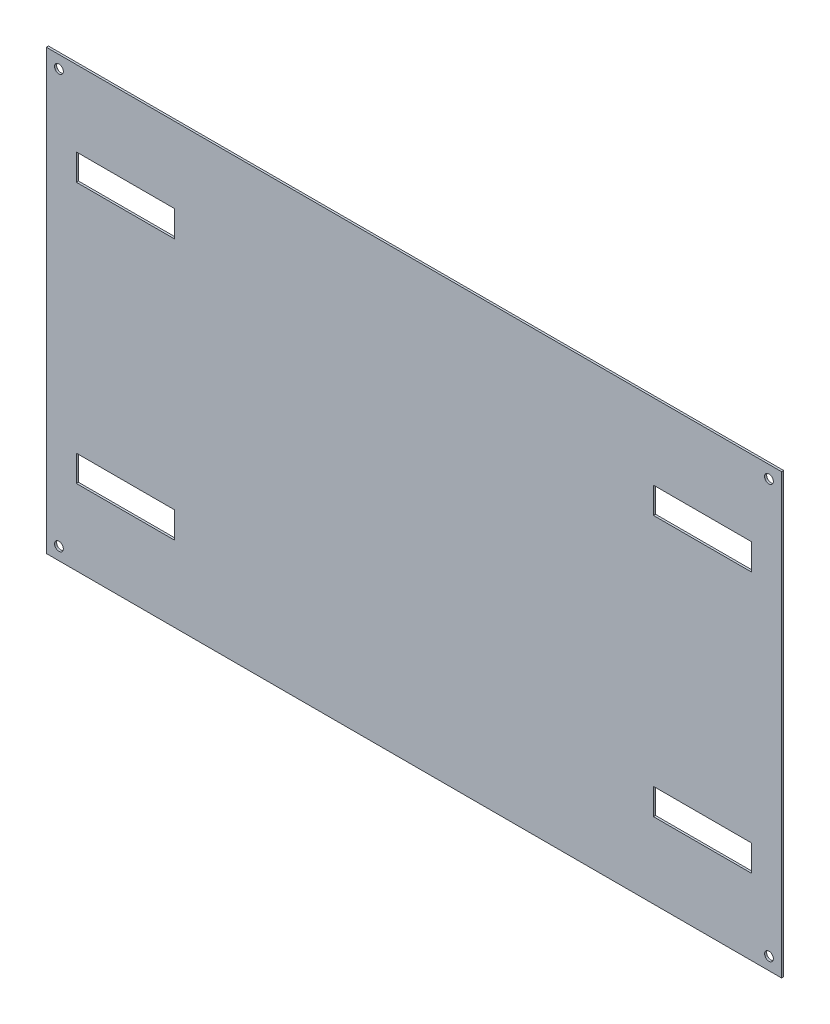
ISO-10303-21;
HEADER;
FILE_DESCRIPTION(('STEP AP214'),'2;1');
FILE_NAME('part.step','',(''),(''),'','','');
FILE_SCHEMA(('AUTOMOTIVE_DESIGN { 1 0 10303 214 1 1 1 1 }'));
ENDSEC;
DATA;
#1=APPLICATION_CONTEXT('core data for automotive mechanical design processes');
#2=APPLICATION_PROTOCOL_DEFINITION('international standard','automotive_design',2000,#1);
#3=PRODUCT_CONTEXT('',#1,'mechanical');
#4=PRODUCT('Part','Part','',(#3));
#5=PRODUCT_RELATED_PRODUCT_CATEGORY('part','',(#4));
#6=PRODUCT_DEFINITION_FORMATION('','',#4);
#7=PRODUCT_DEFINITION_CONTEXT('part definition',#1,'design');
#8=PRODUCT_DEFINITION('design','',#6,#7);
#9=PRODUCT_DEFINITION_SHAPE('','',#8);
#10=(LENGTH_UNIT() NAMED_UNIT(*) SI_UNIT(.MILLI.,.METRE.));
#11=(NAMED_UNIT(*) PLANE_ANGLE_UNIT() SI_UNIT($,.RADIAN.));
#12=(NAMED_UNIT(*) SI_UNIT($,.STERADIAN.) SOLID_ANGLE_UNIT());
#13=UNCERTAINTY_MEASURE_WITH_UNIT(LENGTH_MEASURE(1.E-05),#10,'distance_accuracy_value','');
#14=(GEOMETRIC_REPRESENTATION_CONTEXT(3) GLOBAL_UNCERTAINTY_ASSIGNED_CONTEXT((#13)) GLOBAL_UNIT_ASSIGNED_CONTEXT((#10,
#11,#12)) REPRESENTATION_CONTEXT('',''));
#15=CARTESIAN_POINT('',(0.,0.,0.));
#16=DIRECTION('',(0.,0.,1.));
#17=DIRECTION('',(1.,0.,0.));
#18=AXIS2_PLACEMENT_3D('',#15,#16,#17);
#19=CARTESIAN_POINT('',(0.,0.,2.4));
#20=DIRECTION('',(0.,0.,-1.));
#21=DIRECTION('',(-1.,0.,0.));
#22=AXIS2_PLACEMENT_3D('',#19,#20,#21);
#23=PLANE('',#22);
#24=DIRECTION('',(0.,1.,0.));
#25=VECTOR('',#24,1.);
#26=CARTESIAN_POINT('',(693.68,86.4699999999982,2.4));
#27=LINE('',#26,#25);
#28=CARTESIAN_POINT('',(693.68,86.4699999999982,2.4));
#29=VERTEX_POINT('',#28);
#30=CARTESIAN_POINT('',(693.68,116.469999999998,2.4));
#31=VERTEX_POINT('',#30);
#32=EDGE_CURVE('E212',#29,#31,#27,.T.);
#33=ORIENTED_EDGE('',*,*,#32,.T.);
#34=DIRECTION('',(1.,0.,0.));
#35=VECTOR('',#34,1.);
#36=CARTESIAN_POINT('',(805.68,116.469999999998,2.4));
#37=LINE('',#36,#35);
#38=CARTESIAN_POINT('',(805.68,116.469999999998,2.4));
#39=VERTEX_POINT('',#38);
#40=EDGE_CURVE('E227',#31,#39,#37,.T.);
#41=ORIENTED_EDGE('',*,*,#40,.T.);
#42=DIRECTION('',(0.,-1.,0.));
#43=VECTOR('',#42,1.);
#44=CARTESIAN_POINT('',(805.68,116.469999999998,2.4));
#45=LINE('',#44,#43);
#46=CARTESIAN_POINT('',(805.68,86.4699999999982,2.4));
#47=VERTEX_POINT('',#46);
#48=EDGE_CURVE('E224',#39,#47,#45,.T.);
#49=ORIENTED_EDGE('',*,*,#48,.T.);
#50=DIRECTION('',(-1.,0.,0.));
#51=VECTOR('',#50,1.);
#52=CARTESIAN_POINT('',(693.68,86.4699999999982,2.4));
#53=LINE('',#52,#51);
#54=EDGE_CURVE('E221',#47,#29,#53,.T.);
#55=ORIENTED_EDGE('',*,*,#54,.T.);
#56=EDGE_LOOP('',(#33,#41,#49,#55));
#57=FACE_BOUND('',#56,.T.);
#58=DIRECTION('',(-1.,0.,0.));
#59=VECTOR('',#58,1.);
#60=CARTESIAN_POINT('',(34.32,116.469999999998,2.4));
#61=LINE('',#60,#59);
#62=CARTESIAN_POINT('',(146.32,116.469999999998,2.4));
#63=VERTEX_POINT('',#62);
#64=CARTESIAN_POINT('',(34.32,116.469999999998,2.4));
#65=VERTEX_POINT('',#64);
#66=EDGE_CURVE('E241',#63,#65,#61,.T.);
#67=ORIENTED_EDGE('',*,*,#66,.F.);
#68=DIRECTION('',(0.,1.,0.));
#69=VECTOR('',#68,1.);
#70=CARTESIAN_POINT('',(146.32,86.4699999999984,2.4));
#71=LINE('',#70,#69);
#72=CARTESIAN_POINT('',(146.32,86.4699999999984,2.4));
#73=VERTEX_POINT('',#72);
#74=EDGE_CURVE('E233',#73,#63,#71,.T.);
#75=ORIENTED_EDGE('',*,*,#74,.F.);
#76=DIRECTION('',(1.,0.,0.));
#77=VECTOR('',#76,1.);
#78=CARTESIAN_POINT('',(146.32,86.4699999999984,2.4));
#79=LINE('',#78,#77);
#80=CARTESIAN_POINT('',(34.32,86.4699999999984,2.4));
#81=VERTEX_POINT('',#80);
#82=EDGE_CURVE('E247',#81,#73,#79,.T.);
#83=ORIENTED_EDGE('',*,*,#82,.F.);
#84=DIRECTION('',(0.,-1.,0.));
#85=VECTOR('',#84,1.);
#86=CARTESIAN_POINT('',(34.32,116.469999999998,2.4));
#87=LINE('',#86,#85);
#88=EDGE_CURVE('E244',#65,#81,#87,.T.);
#89=ORIENTED_EDGE('',*,*,#88,.F.);
#90=EDGE_LOOP('',(#67,#75,#83,#89));
#91=FACE_BOUND('',#90,.T.);
#92=DIRECTION('',(0.,1.,0.));
#93=VECTOR('',#92,1.);
#94=CARTESIAN_POINT('',(840.,0.,2.4));
#95=LINE('',#94,#93);
#96=CARTESIAN_POINT('',(840.,0.,2.4));
#97=VERTEX_POINT('',#96);
#98=CARTESIAN_POINT('',(840.,501.,2.4));
#99=VERTEX_POINT('',#98);
#100=EDGE_CURVE('E284',#97,#99,#95,.T.);
#101=ORIENTED_EDGE('',*,*,#100,.T.);
#102=DIRECTION('',(-1.,0.,0.));
#103=VECTOR('',#102,1.);
#104=CARTESIAN_POINT('',(0.,501.,2.4));
#105=LINE('',#104,#103);
#106=CARTESIAN_POINT('',(0.,501.,2.4));
#107=VERTEX_POINT('',#106);
#108=EDGE_CURVE('E287',#99,#107,#105,.T.);
#109=ORIENTED_EDGE('',*,*,#108,.T.);
#110=DIRECTION('',(0.,-1.,0.));
#111=VECTOR('',#110,1.);
#112=CARTESIAN_POINT('',(0.,0.,2.4));
#113=LINE('',#112,#111);
#114=CARTESIAN_POINT('',(0.,0.,2.4));
#115=VERTEX_POINT('',#114);
#116=EDGE_CURVE('E290',#107,#115,#113,.T.);
#117=ORIENTED_EDGE('',*,*,#116,.T.);
#118=DIRECTION('',(1.,0.,0.));
#119=VECTOR('',#118,1.);
#120=CARTESIAN_POINT('',(0.,0.,2.4));
#121=LINE('',#120,#119);
#122=EDGE_CURVE('E292',#115,#97,#121,.T.);
#123=ORIENTED_EDGE('',*,*,#122,.T.);
#124=EDGE_LOOP('',(#101,#109,#117,#123));
#125=FACE_BOUND('',#124,.T.);
#126=CARTESIAN_POINT('',(14.375,486.625,2.4));
#127=DIRECTION('',(0.,0.,1.));
#128=DIRECTION('',(-1.,0.,0.));
#129=AXIS2_PLACEMENT_3D('',#126,#127,#128);
#130=CIRCLE('',#129,5.00000000000005);
#131=CARTESIAN_POINT('',(9.37499999999998,486.625,2.4));
#132=VERTEX_POINT('',#131);
#133=EDGE_CURVE('E278',#132,#132,#130,.T.);
#134=ORIENTED_EDGE('',*,*,#133,.F.);
#135=EDGE_LOOP('',(#134));
#136=FACE_BOUND('',#135,.T.);
#137=CARTESIAN_POINT('',(825.625,14.375,2.4));
#138=DIRECTION('',(0.,0.,1.));
#139=DIRECTION('',(-1.,0.,0.));
#140=AXIS2_PLACEMENT_3D('',#137,#138,#139);
#141=CIRCLE('',#140,5.00000000000015);
#142=CARTESIAN_POINT('',(820.625,14.375,2.4));
#143=VERTEX_POINT('',#142);
#144=EDGE_CURVE('E272',#143,#143,#141,.T.);
#145=ORIENTED_EDGE('',*,*,#144,.F.);
#146=EDGE_LOOP('',(#145));
#147=FACE_BOUND('',#146,.T.);
#148=CARTESIAN_POINT('',(825.625,486.625,2.4));
#149=DIRECTION('',(0.,0.,1.));
#150=DIRECTION('',(1.,0.,0.));
#151=AXIS2_PLACEMENT_3D('',#148,#149,#150);
#152=CIRCLE('',#151,5.00000000000005);
#153=CARTESIAN_POINT('',(830.625,486.625,2.4));
#154=VERTEX_POINT('',#153);
#155=EDGE_CURVE('E266',#154,#154,#152,.T.);
#156=ORIENTED_EDGE('',*,*,#155,.F.);
#157=EDGE_LOOP('',(#156));
#158=FACE_BOUND('',#157,.T.);
#159=CARTESIAN_POINT('',(14.375,14.375,2.4));
#160=DIRECTION('',(0.,0.,1.));
#161=DIRECTION('',(1.,0.,0.));
#162=AXIS2_PLACEMENT_3D('',#159,#160,#161);
#163=CIRCLE('',#162,5.);
#164=CARTESIAN_POINT('',(19.375,14.375,2.4));
#165=VERTEX_POINT('',#164);
#166=EDGE_CURVE('E260',#165,#165,#163,.T.);
#167=ORIENTED_EDGE('',*,*,#166,.F.);
#168=EDGE_LOOP('',(#167));
#169=FACE_BOUND('',#168,.T.);
#170=DIRECTION('',(1.,0.,0.));
#171=VECTOR('',#170,1.);
#172=CARTESIAN_POINT('',(805.68,384.530000000001,2.4));
#173=LINE('',#172,#171);
#174=CARTESIAN_POINT('',(693.68,384.530000000001,2.4));
#175=VERTEX_POINT('',#174);
#176=CARTESIAN_POINT('',(805.68,384.530000000001,2.4));
#177=VERTEX_POINT('',#176);
#178=EDGE_CURVE('E200',#175,#177,#173,.T.);
#179=ORIENTED_EDGE('',*,*,#178,.F.);
#180=DIRECTION('',(0.,-1.,0.));
#181=VECTOR('',#180,1.);
#182=CARTESIAN_POINT('',(693.68,414.530000000001,2.4));
#183=LINE('',#182,#181);
#184=CARTESIAN_POINT('',(693.68,414.530000000001,2.4));
#185=VERTEX_POINT('',#184);
#186=EDGE_CURVE('E196',#185,#175,#183,.T.);
#187=ORIENTED_EDGE('',*,*,#186,.F.);
#188=DIRECTION('',(-1.,0.,0.));
#189=VECTOR('',#188,1.);
#190=CARTESIAN_POINT('',(693.68,414.530000000001,2.4));
#191=LINE('',#190,#189);
#192=CARTESIAN_POINT('',(805.68,414.530000000001,2.4));
#193=VERTEX_POINT('',#192);
#194=EDGE_CURVE('E206',#193,#185,#191,.T.);
#195=ORIENTED_EDGE('',*,*,#194,.F.);
#196=DIRECTION('',(0.,1.,0.));
#197=VECTOR('',#196,1.);
#198=CARTESIAN_POINT('',(805.68,384.530000000001,2.4));
#199=LINE('',#198,#197);
#200=EDGE_CURVE('E203',#177,#193,#199,.T.);
#201=ORIENTED_EDGE('',*,*,#200,.F.);
#202=EDGE_LOOP('',(#179,#187,#195,#201));
#203=FACE_BOUND('',#202,.T.);
#204=DIRECTION('',(0.,-1.,0.));
#205=VECTOR('',#204,1.);
#206=CARTESIAN_POINT('',(146.32,414.530000000002,2.4));
#207=LINE('',#206,#205);
#208=CARTESIAN_POINT('',(146.32,414.530000000002,2.4));
#209=VERTEX_POINT('',#208);
#210=CARTESIAN_POINT('',(146.32,384.530000000002,2.4));
#211=VERTEX_POINT('',#210);
#212=EDGE_CURVE('E50',#209,#211,#207,.T.);
#213=ORIENTED_EDGE('',*,*,#212,.T.);
#214=DIRECTION('',(-1.,0.,0.));
#215=VECTOR('',#214,1.);
#216=CARTESIAN_POINT('',(34.3200000000001,384.530000000002,2.4));
#217=LINE('',#216,#215);
#218=CARTESIAN_POINT('',(34.3200000000001,384.530000000002,2.4));
#219=VERTEX_POINT('',#218);
#220=EDGE_CURVE('E189',#211,#219,#217,.T.);
#221=ORIENTED_EDGE('',*,*,#220,.T.);
#222=DIRECTION('',(0.,1.,0.));
#223=VECTOR('',#222,1.);
#224=CARTESIAN_POINT('',(34.3200000000001,384.530000000002,2.4));
#225=LINE('',#224,#223);
#226=CARTESIAN_POINT('',(34.3200000000001,414.530000000002,2.4));
#227=VERTEX_POINT('',#226);
#228=EDGE_CURVE('E175',#219,#227,#225,.T.);
#229=ORIENTED_EDGE('',*,*,#228,.T.);
#230=DIRECTION('',(1.,0.,0.));
#231=VECTOR('',#230,1.);
#232=CARTESIAN_POINT('',(146.32,414.530000000002,2.4));
#233=LINE('',#232,#231);
#234=EDGE_CURVE('E184',#227,#209,#233,.T.);
#235=ORIENTED_EDGE('',*,*,#234,.T.);
#236=EDGE_LOOP('',(#213,#221,#229,#235));
#237=FACE_BOUND('',#236,.T.);
#238=ADVANCED_FACE('F35',(#57,#91,#125,#136,#147,#158,#169,#203,#237),#23,.F.);
#239=CARTESIAN_POINT('',(0.,0.,0.));
#240=DIRECTION('',(0.,0.,-1.));
#241=DIRECTION('',(-1.,0.,0.));
#242=AXIS2_PLACEMENT_3D('',#239,#240,#241);
#243=PLANE('',#242);
#244=DIRECTION('',(0.,1.,0.));
#245=VECTOR('',#244,1.);
#246=CARTESIAN_POINT('',(693.68,0.,0.));
#247=LINE('',#246,#245);
#248=CARTESIAN_POINT('',(693.68,384.530000000001,0.));
#249=VERTEX_POINT('',#248);
#250=CARTESIAN_POINT('',(693.68,414.530000000001,0.));
#251=VERTEX_POINT('',#250);
#252=EDGE_CURVE('E341',#249,#251,#247,.T.);
#253=ORIENTED_EDGE('',*,*,#252,.F.);
#254=DIRECTION('',(-1.,0.,0.));
#255=VECTOR('',#254,1.);
#256=CARTESIAN_POINT('',(0.,384.530000000002,0.));
#257=LINE('',#256,#255);
#258=CARTESIAN_POINT('',(805.68,384.530000000001,0.));
#259=VERTEX_POINT('',#258);
#260=EDGE_CURVE('E334',#259,#249,#257,.T.);
#261=ORIENTED_EDGE('',*,*,#260,.F.);
#262=DIRECTION('',(0.,-1.,0.));
#263=VECTOR('',#262,1.);
#264=CARTESIAN_POINT('',(805.68,0.,0.));
#265=LINE('',#264,#263);
#266=CARTESIAN_POINT('',(805.68,414.530000000001,0.));
#267=VERTEX_POINT('',#266);
#268=EDGE_CURVE('E336',#267,#259,#265,.T.);
#269=ORIENTED_EDGE('',*,*,#268,.F.);
#270=DIRECTION('',(1.,0.,0.));
#271=VECTOR('',#270,1.);
#272=CARTESIAN_POINT('',(0.,414.530000000002,0.));
#273=LINE('',#272,#271);
#274=EDGE_CURVE('E339',#251,#267,#273,.T.);
#275=ORIENTED_EDGE('',*,*,#274,.F.);
#276=EDGE_LOOP('',(#253,#261,#269,#275));
#277=FACE_BOUND('',#276,.T.);
#278=DIRECTION('',(0.,-1.,0.));
#279=VECTOR('',#278,1.);
#280=CARTESIAN_POINT('',(146.32,0.,0.));
#281=LINE('',#280,#279);
#282=CARTESIAN_POINT('',(146.32,116.469999999998,0.));
#283=VERTEX_POINT('',#282);
#284=CARTESIAN_POINT('',(146.32,86.4699999999984,0.));
#285=VERTEX_POINT('',#284);
#286=EDGE_CURVE('E320',#283,#285,#281,.T.);
#287=ORIENTED_EDGE('',*,*,#286,.F.);
#288=DIRECTION('',(1.,0.,0.));
#289=VECTOR('',#288,1.);
#290=CARTESIAN_POINT('',(0.,116.469999999998,0.));
#291=LINE('',#290,#289);
#292=CARTESIAN_POINT('',(34.32,116.469999999998,0.));
#293=VERTEX_POINT('',#292);
#294=EDGE_CURVE('E313',#293,#283,#291,.T.);
#295=ORIENTED_EDGE('',*,*,#294,.F.);
#296=DIRECTION('',(0.,1.,0.));
#297=VECTOR('',#296,1.);
#298=CARTESIAN_POINT('',(34.32,0.,0.));
#299=LINE('',#298,#297);
#300=CARTESIAN_POINT('',(34.32,86.4699999999984,0.));
#301=VERTEX_POINT('',#300);
#302=EDGE_CURVE('E315',#301,#293,#299,.T.);
#303=ORIENTED_EDGE('',*,*,#302,.F.);
#304=DIRECTION('',(-1.,0.,0.));
#305=VECTOR('',#304,1.);
#306=CARTESIAN_POINT('',(0.,86.4699999999984,0.));
#307=LINE('',#306,#305);
#308=EDGE_CURVE('E318',#285,#301,#307,.T.);
#309=ORIENTED_EDGE('',*,*,#308,.F.);
#310=EDGE_LOOP('',(#287,#295,#303,#309));
#311=FACE_BOUND('',#310,.T.);
#312=CARTESIAN_POINT('',(825.625,486.625,0.));
#313=DIRECTION('',(0.,0.,1.));
#314=DIRECTION('',(1.,0.,0.));
#315=AXIS2_PLACEMENT_3D('',#312,#313,#314);
#316=CIRCLE('',#315,5.00000000000005);
#317=CARTESIAN_POINT('',(830.625,486.625,0.));
#318=VERTEX_POINT('',#317);
#319=EDGE_CURVE('E263',#318,#318,#316,.T.);
#320=ORIENTED_EDGE('',*,*,#319,.T.);
#321=EDGE_LOOP('',(#320));
#322=FACE_BOUND('',#321,.T.);
#323=CARTESIAN_POINT('',(14.375,486.625,0.));
#324=DIRECTION('',(0.,0.,1.));
#325=DIRECTION('',(-1.,0.,0.));
#326=AXIS2_PLACEMENT_3D('',#323,#324,#325);
#327=CIRCLE('',#326,5.00000000000005);
#328=CARTESIAN_POINT('',(9.37499999999998,486.625,0.));
#329=VERTEX_POINT('',#328);
#330=EDGE_CURVE('E275',#329,#329,#327,.T.);
#331=ORIENTED_EDGE('',*,*,#330,.T.);
#332=EDGE_LOOP('',(#331));
#333=FACE_BOUND('',#332,.T.);
#334=DIRECTION('',(0.,1.,0.));
#335=VECTOR('',#334,1.);
#336=CARTESIAN_POINT('',(840.,0.,0.));
#337=LINE('',#336,#335);
#338=CARTESIAN_POINT('',(840.,0.,0.));
#339=VERTEX_POINT('',#338);
#340=CARTESIAN_POINT('',(840.,501.,0.));
#341=VERTEX_POINT('',#340);
#342=EDGE_CURVE('E281',#339,#341,#337,.T.);
#343=ORIENTED_EDGE('',*,*,#342,.F.);
#344=DIRECTION('',(1.,0.,0.));
#345=VECTOR('',#344,1.);
#346=CARTESIAN_POINT('',(0.,0.,0.));
#347=LINE('',#346,#345);
#348=CARTESIAN_POINT('',(0.,0.,0.));
#349=VERTEX_POINT('',#348);
#350=EDGE_CURVE('E288',#349,#339,#347,.T.);
#351=ORIENTED_EDGE('',*,*,#350,.F.);
#352=DIRECTION('',(0.,-1.,0.));
#353=VECTOR('',#352,1.);
#354=CARTESIAN_POINT('',(0.,0.,0.));
#355=LINE('',#354,#353);
#356=CARTESIAN_POINT('',(0.,501.,0.));
#357=VERTEX_POINT('',#356);
#358=EDGE_CURVE('E299',#357,#349,#355,.T.);
#359=ORIENTED_EDGE('',*,*,#358,.F.);
#360=DIRECTION('',(-1.,0.,0.));
#361=VECTOR('',#360,1.);
#362=CARTESIAN_POINT('',(0.,501.,0.));
#363=LINE('',#362,#361);
#364=EDGE_CURVE('E297',#341,#357,#363,.T.);
#365=ORIENTED_EDGE('',*,*,#364,.F.);
#366=EDGE_LOOP('',(#343,#351,#359,#365));
#367=FACE_BOUND('',#366,.T.);
#368=CARTESIAN_POINT('',(825.625,14.375,0.));
#369=DIRECTION('',(0.,0.,1.));
#370=DIRECTION('',(-1.,0.,0.));
#371=AXIS2_PLACEMENT_3D('',#368,#369,#370);
#372=CIRCLE('',#371,5.00000000000015);
#373=CARTESIAN_POINT('',(820.625,14.375,0.));
#374=VERTEX_POINT('',#373);
#375=EDGE_CURVE('E269',#374,#374,#372,.T.);
#376=ORIENTED_EDGE('',*,*,#375,.T.);
#377=EDGE_LOOP('',(#376));
#378=FACE_BOUND('',#377,.T.);
#379=CARTESIAN_POINT('',(14.375,14.375,0.));
#380=DIRECTION('',(0.,0.,1.));
#381=DIRECTION('',(1.,0.,0.));
#382=AXIS2_PLACEMENT_3D('',#379,#380,#381);
#383=CIRCLE('',#382,5.);
#384=CARTESIAN_POINT('',(19.375,14.375,0.));
#385=VERTEX_POINT('',#384);
#386=EDGE_CURVE('E253',#385,#385,#383,.T.);
#387=ORIENTED_EDGE('',*,*,#386,.T.);
#388=EDGE_LOOP('',(#387));
#389=FACE_BOUND('',#388,.T.);
#390=DIRECTION('',(-1.,0.,0.));
#391=VECTOR('',#390,1.);
#392=CARTESIAN_POINT('',(0.,116.469999999999,0.));
#393=LINE('',#392,#391);
#394=CARTESIAN_POINT('',(805.68,116.469999999998,0.));
#395=VERTEX_POINT('',#394);
#396=CARTESIAN_POINT('',(693.68,116.469999999998,0.));
#397=VERTEX_POINT('',#396);
#398=EDGE_CURVE('E328',#395,#397,#393,.T.);
#399=ORIENTED_EDGE('',*,*,#398,.T.);
#400=DIRECTION('',(0.,-1.,0.));
#401=VECTOR('',#400,1.);
#402=CARTESIAN_POINT('',(693.68,-3.07440921246299E-13,0.));
#403=LINE('',#402,#401);
#404=CARTESIAN_POINT('',(693.68,86.4699999999982,0.));
#405=VERTEX_POINT('',#404);
#406=EDGE_CURVE('E331',#397,#405,#403,.T.);
#407=ORIENTED_EDGE('',*,*,#406,.T.);
#408=DIRECTION('',(1.,0.,0.));
#409=VECTOR('',#408,1.);
#410=CARTESIAN_POINT('',(0.,86.4699999999985,0.));
#411=LINE('',#410,#409);
#412=CARTESIAN_POINT('',(805.68,86.4699999999982,0.));
#413=VERTEX_POINT('',#412);
#414=EDGE_CURVE('E322',#405,#413,#411,.T.);
#415=ORIENTED_EDGE('',*,*,#414,.T.);
#416=DIRECTION('',(0.,1.,0.));
#417=VECTOR('',#416,1.);
#418=CARTESIAN_POINT('',(805.68,-3.57079635321356E-13,0.));
#419=LINE('',#418,#417);
#420=EDGE_CURVE('E325',#413,#395,#419,.T.);
#421=ORIENTED_EDGE('',*,*,#420,.T.);
#422=EDGE_LOOP('',(#399,#407,#415,#421));
#423=FACE_BOUND('',#422,.T.);
#424=DIRECTION('',(1.,0.,0.));
#425=VECTOR('',#424,1.);
#426=CARTESIAN_POINT('',(2.03292409361482E-13,384.530000000002,0.));
#427=LINE('',#426,#425);
#428=CARTESIAN_POINT('',(34.3200000000001,384.530000000002,0.));
#429=VERTEX_POINT('',#428);
#430=CARTESIAN_POINT('',(146.32,384.530000000002,0.));
#431=VERTEX_POINT('',#430);
#432=EDGE_CURVE('E43',#429,#431,#427,.T.);
#433=ORIENTED_EDGE('',*,*,#432,.T.);
#434=DIRECTION('',(0.,1.,0.));
#435=VECTOR('',#434,1.);
#436=CARTESIAN_POINT('',(146.32,0.,0.));
#437=LINE('',#436,#435);
#438=CARTESIAN_POINT('',(146.32,414.530000000002,0.));
#439=VERTEX_POINT('',#438);
#440=EDGE_CURVE('E11',#431,#439,#437,.T.);
#441=ORIENTED_EDGE('',*,*,#440,.T.);
#442=DIRECTION('',(-1.,0.,0.));
#443=VECTOR('',#442,1.);
#444=CARTESIAN_POINT('',(2.19152738284699E-13,414.530000000002,0.));
#445=LINE('',#444,#443);
#446=CARTESIAN_POINT('',(34.3200000000001,414.530000000002,0.));
#447=VERTEX_POINT('',#446);
#448=EDGE_CURVE('E343',#439,#447,#445,.T.);
#449=ORIENTED_EDGE('',*,*,#448,.T.);
#450=DIRECTION('',(0.,-1.,0.));
#451=VECTOR('',#450,1.);
#452=CARTESIAN_POINT('',(34.3199999999999,0.,0.));
#453=LINE('',#452,#451);
#454=EDGE_CURVE('E178',#447,#429,#453,.T.);
#455=ORIENTED_EDGE('',*,*,#454,.T.);
#456=EDGE_LOOP('',(#433,#441,#449,#455));
#457=FACE_BOUND('',#456,.T.);
#458=ADVANCED_FACE('F347',(#277,#311,#322,#333,#367,#378,#389,#423,#457),#243,.T.);
#459=CARTESIAN_POINT('',(840.,0.,2.4));
#460=DIRECTION('',(-1.,0.,0.));
#461=DIRECTION('',(0.,-1.,0.));
#462=AXIS2_PLACEMENT_3D('',#459,#460,#461);
#463=PLANE('',#462);
#464=ORIENTED_EDGE('',*,*,#342,.T.);
#465=DIRECTION('',(0.,0.,-1.));
#466=VECTOR('',#465,1.);
#467=CARTESIAN_POINT('',(840.,501.,2.4));
#468=LINE('',#467,#466);
#469=EDGE_CURVE('E310',#99,#341,#468,.T.);
#470=ORIENTED_EDGE('',*,*,#469,.F.);
#471=ORIENTED_EDGE('',*,*,#100,.F.);
#472=DIRECTION('',(0.,0.,-1.));
#473=VECTOR('',#472,1.);
#474=CARTESIAN_POINT('',(840.,0.,2.4));
#475=LINE('',#474,#473);
#476=EDGE_CURVE('E294',#97,#339,#475,.T.);
#477=ORIENTED_EDGE('',*,*,#476,.T.);
#478=EDGE_LOOP('',(#464,#470,#471,#477));
#479=FACE_BOUND('',#478,.T.);
#480=ADVANCED_FACE('F37',(#479),#463,.F.);
#481=CARTESIAN_POINT('',(0.,501.,2.4));
#482=DIRECTION('',(0.,-1.,0.));
#483=DIRECTION('',(1.,0.,0.));
#484=AXIS2_PLACEMENT_3D('',#481,#482,#483);
#485=PLANE('',#484);
#486=ORIENTED_EDGE('',*,*,#364,.T.);
#487=DIRECTION('',(0.,0.,-1.));
#488=VECTOR('',#487,1.);
#489=CARTESIAN_POINT('',(0.,501.,2.4));
#490=LINE('',#489,#488);
#491=EDGE_CURVE('E307',#107,#357,#490,.T.);
#492=ORIENTED_EDGE('',*,*,#491,.F.);
#493=ORIENTED_EDGE('',*,*,#108,.F.);
#494=ORIENTED_EDGE('',*,*,#469,.T.);
#495=EDGE_LOOP('',(#486,#492,#493,#494));
#496=FACE_BOUND('',#495,.T.);
#497=ADVANCED_FACE('F384',(#496),#485,.F.);
#498=CARTESIAN_POINT('',(0.,0.,2.4));
#499=DIRECTION('',(1.,0.,0.));
#500=DIRECTION('',(0.,0.,-1.));
#501=AXIS2_PLACEMENT_3D('',#498,#499,#500);
#502=PLANE('',#501);
#503=ORIENTED_EDGE('',*,*,#358,.T.);
#504=DIRECTION('',(0.,0.,-1.));
#505=VECTOR('',#504,1.);
#506=CARTESIAN_POINT('',(0.,0.,2.4));
#507=LINE('',#506,#505);
#508=EDGE_CURVE('E304',#115,#349,#507,.T.);
#509=ORIENTED_EDGE('',*,*,#508,.F.);
#510=ORIENTED_EDGE('',*,*,#116,.F.);
#511=ORIENTED_EDGE('',*,*,#491,.T.);
#512=EDGE_LOOP('',(#503,#509,#510,#511));
#513=FACE_BOUND('',#512,.T.);
#514=ADVANCED_FACE('F381',(#513),#502,.F.);
#515=CARTESIAN_POINT('',(0.,0.,2.4));
#516=DIRECTION('',(0.,1.,0.));
#517=DIRECTION('',(0.,0.,1.));
#518=AXIS2_PLACEMENT_3D('',#515,#516,#517);
#519=PLANE('',#518);
#520=ORIENTED_EDGE('',*,*,#350,.T.);
#521=ORIENTED_EDGE('',*,*,#476,.F.);
#522=ORIENTED_EDGE('',*,*,#122,.F.);
#523=ORIENTED_EDGE('',*,*,#508,.T.);
#524=EDGE_LOOP('',(#520,#521,#522,#523));
#525=FACE_BOUND('',#524,.T.);
#526=ADVANCED_FACE('F378',(#525),#519,.F.);
#527=CARTESIAN_POINT('',(14.375,486.625,2.4));
#528=DIRECTION('',(0.,0.,-1.));
#529=DIRECTION('',(-1.,0.,0.));
#530=AXIS2_PLACEMENT_3D('',#527,#528,#529);
#531=CYLINDRICAL_SURFACE('',#530,5.00000000000005);
#532=ORIENTED_EDGE('',*,*,#133,.T.);
#533=EDGE_LOOP('',(#532));
#534=FACE_BOUND('',#533,.T.);
#535=ORIENTED_EDGE('',*,*,#330,.F.);
#536=EDGE_LOOP('',(#535));
#537=FACE_BOUND('',#536,.T.);
#538=ADVANCED_FACE('F375',(#534,#537),#531,.F.);
#539=CARTESIAN_POINT('',(825.625,14.375,2.4));
#540=DIRECTION('',(0.,0.,-1.));
#541=DIRECTION('',(-1.,0.,0.));
#542=AXIS2_PLACEMENT_3D('',#539,#540,#541);
#543=CYLINDRICAL_SURFACE('',#542,5.00000000000015);
#544=ORIENTED_EDGE('',*,*,#144,.T.);
#545=EDGE_LOOP('',(#544));
#546=FACE_BOUND('',#545,.T.);
#547=ORIENTED_EDGE('',*,*,#375,.F.);
#548=EDGE_LOOP('',(#547));
#549=FACE_BOUND('',#548,.T.);
#550=ADVANCED_FACE('F477',(#546,#549),#543,.F.);
#551=CARTESIAN_POINT('',(825.625,486.625,2.4));
#552=DIRECTION('',(0.,0.,-1.));
#553=DIRECTION('',(-1.,0.,0.));
#554=AXIS2_PLACEMENT_3D('',#551,#552,#553);
#555=CYLINDRICAL_SURFACE('',#554,5.00000000000005);
#556=ORIENTED_EDGE('',*,*,#155,.T.);
#557=EDGE_LOOP('',(#556));
#558=FACE_BOUND('',#557,.T.);
#559=ORIENTED_EDGE('',*,*,#319,.F.);
#560=EDGE_LOOP('',(#559));
#561=FACE_BOUND('',#560,.T.);
#562=ADVANCED_FACE('F474',(#558,#561),#555,.F.);
#563=CARTESIAN_POINT('',(14.375,14.375,2.4));
#564=DIRECTION('',(0.,0.,-1.));
#565=DIRECTION('',(-1.,0.,0.));
#566=AXIS2_PLACEMENT_3D('',#563,#564,#565);
#567=CYLINDRICAL_SURFACE('',#566,5.);
#568=ORIENTED_EDGE('',*,*,#166,.T.);
#569=EDGE_LOOP('',(#568));
#570=FACE_BOUND('',#569,.T.);
#571=ORIENTED_EDGE('',*,*,#386,.F.);
#572=EDGE_LOOP('',(#571));
#573=FACE_BOUND('',#572,.T.);
#574=ADVANCED_FACE('F470',(#570,#573),#567,.F.);
#575=CARTESIAN_POINT('',(146.32,86.4699999999984,-31.6));
#576=DIRECTION('',(1.,0.,0.));
#577=DIRECTION('',(0.,0.,-1.));
#578=AXIS2_PLACEMENT_3D('',#575,#576,#577);
#579=PLANE('',#578);
#580=ORIENTED_EDGE('',*,*,#286,.T.);
#581=DIRECTION('',(0.,0.,1.));
#582=VECTOR('',#581,1.);
#583=CARTESIAN_POINT('',(146.32,86.4699999999984,-31.6));
#584=LINE('',#583,#582);
#585=EDGE_CURVE('E251',#285,#73,#584,.T.);
#586=ORIENTED_EDGE('',*,*,#585,.T.);
#587=ORIENTED_EDGE('',*,*,#74,.T.);
#588=DIRECTION('',(0.,0.,1.));
#589=VECTOR('',#588,1.);
#590=CARTESIAN_POINT('',(146.32,116.469999999998,-31.6));
#591=LINE('',#590,#589);
#592=EDGE_CURVE('E250',#283,#63,#591,.T.);
#593=ORIENTED_EDGE('',*,*,#592,.F.);
#594=EDGE_LOOP('',(#580,#586,#587,#593));
#595=FACE_BOUND('',#594,.T.);
#596=ADVANCED_FACE('F460',(#595),#579,.F.);
#597=CARTESIAN_POINT('',(146.32,86.4699999999984,-31.6));
#598=DIRECTION('',(0.,-1.,0.));
#599=DIRECTION('',(0.,0.,-1.));
#600=AXIS2_PLACEMENT_3D('',#597,#598,#599);
#601=PLANE('',#600);
#602=ORIENTED_EDGE('',*,*,#308,.T.);
#603=DIRECTION('',(0.,0.,1.));
#604=VECTOR('',#603,1.);
#605=CARTESIAN_POINT('',(34.32,86.4699999999984,-31.6));
#606=LINE('',#605,#604);
#607=EDGE_CURVE('E254',#301,#81,#606,.T.);
#608=ORIENTED_EDGE('',*,*,#607,.T.);
#609=ORIENTED_EDGE('',*,*,#82,.T.);
#610=ORIENTED_EDGE('',*,*,#585,.F.);
#611=EDGE_LOOP('',(#602,#608,#609,#610));
#612=FACE_BOUND('',#611,.T.);
#613=ADVANCED_FACE('F456',(#612),#601,.F.);
#614=CARTESIAN_POINT('',(34.32,116.469999999998,-31.6));
#615=DIRECTION('',(-1.,0.,0.));
#616=DIRECTION('',(0.,0.,1.));
#617=AXIS2_PLACEMENT_3D('',#614,#615,#616);
#618=PLANE('',#617);
#619=ORIENTED_EDGE('',*,*,#302,.T.);
#620=DIRECTION('',(0.,0.,1.));
#621=VECTOR('',#620,1.);
#622=CARTESIAN_POINT('',(34.32,116.469999999998,-31.6));
#623=LINE('',#622,#621);
#624=EDGE_CURVE('E256',#293,#65,#623,.T.);
#625=ORIENTED_EDGE('',*,*,#624,.T.);
#626=ORIENTED_EDGE('',*,*,#88,.T.);
#627=ORIENTED_EDGE('',*,*,#607,.F.);
#628=EDGE_LOOP('',(#619,#625,#626,#627));
#629=FACE_BOUND('',#628,.T.);
#630=ADVANCED_FACE('F459',(#629),#618,.F.);
#631=CARTESIAN_POINT('',(34.32,116.469999999998,-31.6));
#632=DIRECTION('',(0.,1.,0.));
#633=DIRECTION('',(0.,0.,1.));
#634=AXIS2_PLACEMENT_3D('',#631,#632,#633);
#635=PLANE('',#634);
#636=ORIENTED_EDGE('',*,*,#294,.T.);
#637=ORIENTED_EDGE('',*,*,#592,.T.);
#638=ORIENTED_EDGE('',*,*,#66,.T.);
#639=ORIENTED_EDGE('',*,*,#624,.F.);
#640=EDGE_LOOP('',(#636,#637,#638,#639));
#641=FACE_BOUND('',#640,.T.);
#642=ADVANCED_FACE('F454',(#641),#635,.F.);
#643=CARTESIAN_POINT('',(693.68,86.4699999999982,-31.6));
#644=DIRECTION('',(1.,0.,0.));
#645=DIRECTION('',(0.,1.,0.));
#646=AXIS2_PLACEMENT_3D('',#643,#644,#645);
#647=PLANE('',#646);
#648=DIRECTION('',(0.,0.,1.));
#649=VECTOR('',#648,1.);
#650=CARTESIAN_POINT('',(693.68,116.469999999998,-31.6));
#651=LINE('',#650,#649);
#652=EDGE_CURVE('E231',#397,#31,#651,.T.);
#653=ORIENTED_EDGE('',*,*,#652,.T.);
#654=ORIENTED_EDGE('',*,*,#32,.F.);
#655=DIRECTION('',(0.,0.,1.));
#656=VECTOR('',#655,1.);
#657=CARTESIAN_POINT('',(693.68,86.4699999999982,-31.6));
#658=LINE('',#657,#656);
#659=EDGE_CURVE('E230',#405,#29,#658,.T.);
#660=ORIENTED_EDGE('',*,*,#659,.F.);
#661=ORIENTED_EDGE('',*,*,#406,.F.);
#662=EDGE_LOOP('',(#653,#654,#660,#661));
#663=FACE_BOUND('',#662,.T.);
#664=ADVANCED_FACE('F444',(#663),#647,.T.);
#665=CARTESIAN_POINT('',(805.68,116.469999999998,-31.6));
#666=DIRECTION('',(0.,-1.,0.));
#667=DIRECTION('',(1.,0.,0.));
#668=AXIS2_PLACEMENT_3D('',#665,#666,#667);
#669=PLANE('',#668);
#670=DIRECTION('',(0.,0.,1.));
#671=VECTOR('',#670,1.);
#672=CARTESIAN_POINT('',(805.68,116.469999999998,-31.6));
#673=LINE('',#672,#671);
#674=EDGE_CURVE('E234',#395,#39,#673,.T.);
#675=ORIENTED_EDGE('',*,*,#674,.T.);
#676=ORIENTED_EDGE('',*,*,#40,.F.);
#677=ORIENTED_EDGE('',*,*,#652,.F.);
#678=ORIENTED_EDGE('',*,*,#398,.F.);
#679=EDGE_LOOP('',(#675,#676,#677,#678));
#680=FACE_BOUND('',#679,.T.);
#681=ADVANCED_FACE('F440',(#680),#669,.T.);
#682=CARTESIAN_POINT('',(805.68,116.469999999998,-31.6));
#683=DIRECTION('',(-1.,0.,0.));
#684=DIRECTION('',(0.,-1.,0.));
#685=AXIS2_PLACEMENT_3D('',#682,#683,#684);
#686=PLANE('',#685);
#687=DIRECTION('',(0.,0.,1.));
#688=VECTOR('',#687,1.);
#689=CARTESIAN_POINT('',(805.68,86.4699999999982,-31.6));
#690=LINE('',#689,#688);
#691=EDGE_CURVE('E236',#413,#47,#690,.T.);
#692=ORIENTED_EDGE('',*,*,#691,.T.);
#693=ORIENTED_EDGE('',*,*,#48,.F.);
#694=ORIENTED_EDGE('',*,*,#674,.F.);
#695=ORIENTED_EDGE('',*,*,#420,.F.);
#696=EDGE_LOOP('',(#692,#693,#694,#695));
#697=FACE_BOUND('',#696,.T.);
#698=ADVANCED_FACE('F443',(#697),#686,.T.);
#699=CARTESIAN_POINT('',(693.68,86.4699999999982,-31.6));
#700=DIRECTION('',(0.,1.,0.));
#701=DIRECTION('',(-1.,0.,0.));
#702=AXIS2_PLACEMENT_3D('',#699,#700,#701);
#703=PLANE('',#702);
#704=ORIENTED_EDGE('',*,*,#659,.T.);
#705=ORIENTED_EDGE('',*,*,#54,.F.);
#706=ORIENTED_EDGE('',*,*,#691,.F.);
#707=ORIENTED_EDGE('',*,*,#414,.F.);
#708=EDGE_LOOP('',(#704,#705,#706,#707));
#709=FACE_BOUND('',#708,.T.);
#710=ADVANCED_FACE('F439',(#709),#703,.T.);
#711=CARTESIAN_POINT('',(693.68,414.530000000001,-31.6));
#712=DIRECTION('',(-1.,0.,0.));
#713=DIRECTION('',(0.,-1.,0.));
#714=AXIS2_PLACEMENT_3D('',#711,#712,#713);
#715=PLANE('',#714);
#716=ORIENTED_EDGE('',*,*,#252,.T.);
#717=DIRECTION('',(0.,0.,1.));
#718=VECTOR('',#717,1.);
#719=CARTESIAN_POINT('',(693.68,414.530000000001,-31.6));
#720=LINE('',#719,#718);
#721=EDGE_CURVE('E210',#251,#185,#720,.T.);
#722=ORIENTED_EDGE('',*,*,#721,.T.);
#723=ORIENTED_EDGE('',*,*,#186,.T.);
#724=DIRECTION('',(0.,0.,1.));
#725=VECTOR('',#724,1.);
#726=CARTESIAN_POINT('',(693.68,384.530000000001,-31.6));
#727=LINE('',#726,#725);
#728=EDGE_CURVE('E209',#249,#175,#727,.T.);
#729=ORIENTED_EDGE('',*,*,#728,.F.);
#730=EDGE_LOOP('',(#716,#722,#723,#729));
#731=FACE_BOUND('',#730,.T.);
#732=ADVANCED_FACE('F422',(#731),#715,.F.);
#733=CARTESIAN_POINT('',(693.68,414.530000000001,-31.6));
#734=DIRECTION('',(0.,1.,0.));
#735=DIRECTION('',(-1.,0.,0.));
#736=AXIS2_PLACEMENT_3D('',#733,#734,#735);
#737=PLANE('',#736);
#738=ORIENTED_EDGE('',*,*,#274,.T.);
#739=DIRECTION('',(0.,0.,1.));
#740=VECTOR('',#739,1.);
#741=CARTESIAN_POINT('',(805.68,414.530000000001,-31.6));
#742=LINE('',#741,#740);
#743=EDGE_CURVE('E213',#267,#193,#742,.T.);
#744=ORIENTED_EDGE('',*,*,#743,.T.);
#745=ORIENTED_EDGE('',*,*,#194,.T.);
#746=ORIENTED_EDGE('',*,*,#721,.F.);
#747=EDGE_LOOP('',(#738,#744,#745,#746));
#748=FACE_BOUND('',#747,.T.);
#749=ADVANCED_FACE('F429',(#748),#737,.F.);
#750=CARTESIAN_POINT('',(805.68,384.530000000001,-31.6));
#751=DIRECTION('',(1.,0.,0.));
#752=DIRECTION('',(0.,1.,0.));
#753=AXIS2_PLACEMENT_3D('',#750,#751,#752);
#754=PLANE('',#753);
#755=ORIENTED_EDGE('',*,*,#268,.T.);
#756=DIRECTION('',(0.,0.,1.));
#757=VECTOR('',#756,1.);
#758=CARTESIAN_POINT('',(805.68,384.530000000001,-31.6));
#759=LINE('',#758,#757);
#760=EDGE_CURVE('E215',#259,#177,#759,.T.);
#761=ORIENTED_EDGE('',*,*,#760,.T.);
#762=ORIENTED_EDGE('',*,*,#200,.T.);
#763=ORIENTED_EDGE('',*,*,#743,.F.);
#764=EDGE_LOOP('',(#755,#761,#762,#763));
#765=FACE_BOUND('',#764,.T.);
#766=ADVANCED_FACE('F360',(#765),#754,.F.);
#767=CARTESIAN_POINT('',(805.68,384.530000000001,-31.6));
#768=DIRECTION('',(0.,-1.,0.));
#769=DIRECTION('',(1.,0.,0.));
#770=AXIS2_PLACEMENT_3D('',#767,#768,#769);
#771=PLANE('',#770);
#772=ORIENTED_EDGE('',*,*,#260,.T.);
#773=ORIENTED_EDGE('',*,*,#728,.T.);
#774=ORIENTED_EDGE('',*,*,#178,.T.);
#775=ORIENTED_EDGE('',*,*,#760,.F.);
#776=EDGE_LOOP('',(#772,#773,#774,#775));
#777=FACE_BOUND('',#776,.T.);
#778=ADVANCED_FACE('F353',(#777),#771,.F.);
#779=CARTESIAN_POINT('',(146.32,414.530000000002,-31.6));
#780=DIRECTION('',(-1.,0.,0.));
#781=DIRECTION('',(0.,-1.,0.));
#782=AXIS2_PLACEMENT_3D('',#779,#780,#781);
#783=PLANE('',#782);
#784=DIRECTION('',(0.,0.,1.));
#785=VECTOR('',#784,1.);
#786=CARTESIAN_POINT('',(146.32,384.530000000002,-31.6));
#787=LINE('',#786,#785);
#788=EDGE_CURVE('E194',#431,#211,#787,.T.);
#789=ORIENTED_EDGE('',*,*,#788,.T.);
#790=ORIENTED_EDGE('',*,*,#212,.F.);
#791=DIRECTION('',(0.,0.,1.));
#792=VECTOR('',#791,1.);
#793=CARTESIAN_POINT('',(146.32,414.530000000002,-31.6));
#794=LINE('',#793,#792);
#795=EDGE_CURVE('E181',#439,#209,#794,.T.);
#796=ORIENTED_EDGE('',*,*,#795,.F.);
#797=ORIENTED_EDGE('',*,*,#440,.F.);
#798=EDGE_LOOP('',(#789,#790,#796,#797));
#799=FACE_BOUND('',#798,.T.);
#800=ADVANCED_FACE('F351',(#799),#783,.T.);
#801=CARTESIAN_POINT('',(34.3200000000001,384.530000000002,-31.6));
#802=DIRECTION('',(0.,1.,0.));
#803=DIRECTION('',(-1.,0.,0.));
#804=AXIS2_PLACEMENT_3D('',#801,#802,#803);
#805=PLANE('',#804);
#806=DIRECTION('',(0.,0.,1.));
#807=VECTOR('',#806,1.);
#808=CARTESIAN_POINT('',(34.3200000000001,384.530000000002,-31.6));
#809=LINE('',#808,#807);
#810=EDGE_CURVE('E180',#429,#219,#809,.T.);
#811=ORIENTED_EDGE('',*,*,#810,.T.);
#812=ORIENTED_EDGE('',*,*,#220,.F.);
#813=ORIENTED_EDGE('',*,*,#788,.F.);
#814=ORIENTED_EDGE('',*,*,#432,.F.);
#815=EDGE_LOOP('',(#811,#812,#813,#814));
#816=FACE_BOUND('',#815,.T.);
#817=ADVANCED_FACE('F350',(#816),#805,.T.);
#818=CARTESIAN_POINT('',(34.3200000000001,384.530000000002,-31.6));
#819=DIRECTION('',(1.,0.,0.));
#820=DIRECTION('',(0.,1.,0.));
#821=AXIS2_PLACEMENT_3D('',#818,#819,#820);
#822=PLANE('',#821);
#823=DIRECTION('',(0.,0.,1.));
#824=VECTOR('',#823,1.);
#825=CARTESIAN_POINT('',(34.3200000000001,414.530000000002,-31.6));
#826=LINE('',#825,#824);
#827=EDGE_CURVE('E58',#447,#227,#826,.T.);
#828=ORIENTED_EDGE('',*,*,#827,.T.);
#829=ORIENTED_EDGE('',*,*,#228,.F.);
#830=ORIENTED_EDGE('',*,*,#810,.F.);
#831=ORIENTED_EDGE('',*,*,#454,.F.);
#832=EDGE_LOOP('',(#828,#829,#830,#831));
#833=FACE_BOUND('',#832,.T.);
#834=ADVANCED_FACE('F172',(#833),#822,.T.);
#835=CARTESIAN_POINT('',(146.32,414.530000000002,-31.6));
#836=DIRECTION('',(0.,-1.,0.));
#837=DIRECTION('',(1.,0.,0.));
#838=AXIS2_PLACEMENT_3D('',#835,#836,#837);
#839=PLANE('',#838);
#840=ORIENTED_EDGE('',*,*,#795,.T.);
#841=ORIENTED_EDGE('',*,*,#234,.F.);
#842=ORIENTED_EDGE('',*,*,#827,.F.);
#843=ORIENTED_EDGE('',*,*,#448,.F.);
#844=EDGE_LOOP('',(#840,#841,#842,#843));
#845=FACE_BOUND('',#844,.T.);
#846=ADVANCED_FACE('F185',(#845),#839,.T.);
#847=CLOSED_SHELL('',(#238,#458,#480,#497,#514,#526,#538,#550,#562,#574,#596,#613,#630,#642,
#664,#681,#698,#710,#732,#749,#766,#778,#800,#817,#834,#846));
#848=MANIFOLD_SOLID_BREP('B2',#847);
#849=ADVANCED_BREP_SHAPE_REPRESENTATION('',(#18,#848),#14);
#850=SHAPE_DEFINITION_REPRESENTATION(#9,#849);
ENDSEC;
END-ISO-10303-21;
